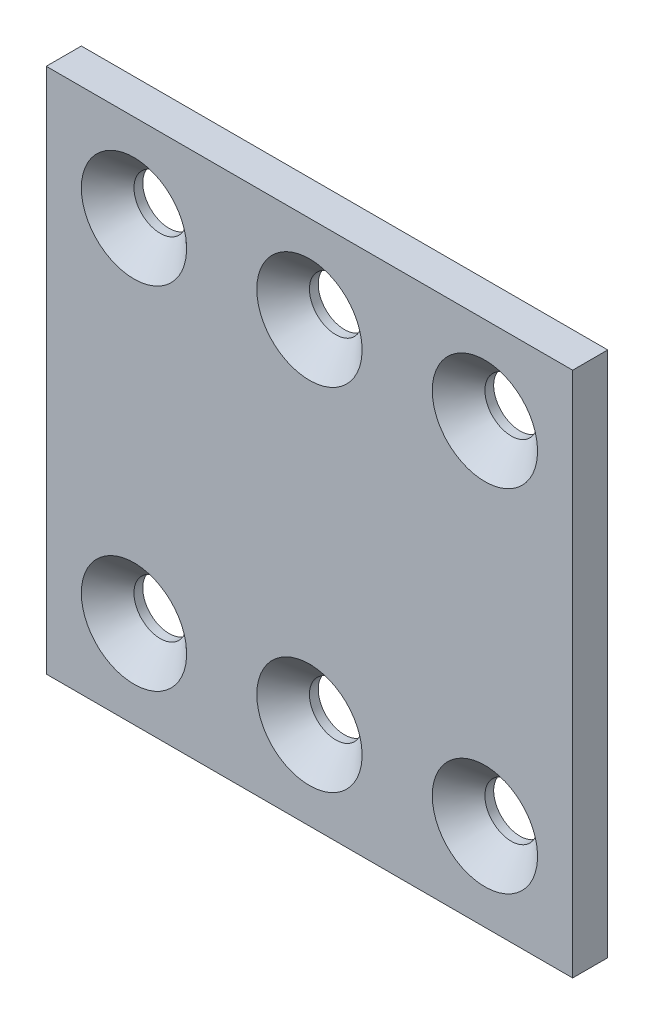
ISO-10303-21;
HEADER;
FILE_DESCRIPTION(('STEP AP214'),'2;1');
FILE_NAME('part.step','',(''),(''),'','','');
FILE_SCHEMA(('AUTOMOTIVE_DESIGN { 1 0 10303 214 1 1 1 1 }'));
ENDSEC;
DATA;
#1=APPLICATION_CONTEXT('core data for automotive mechanical design processes');
#2=APPLICATION_PROTOCOL_DEFINITION('international standard','automotive_design',2000,#1);
#3=PRODUCT_CONTEXT('',#1,'mechanical');
#4=PRODUCT('Part','Part','',(#3));
#5=PRODUCT_RELATED_PRODUCT_CATEGORY('part','',(#4));
#6=PRODUCT_DEFINITION_FORMATION('','',#4);
#7=PRODUCT_DEFINITION_CONTEXT('part definition',#1,'design');
#8=PRODUCT_DEFINITION('design','',#6,#7);
#9=PRODUCT_DEFINITION_SHAPE('','',#8);
#10=(LENGTH_UNIT() NAMED_UNIT(*) SI_UNIT(.MILLI.,.METRE.));
#11=(NAMED_UNIT(*) PLANE_ANGLE_UNIT() SI_UNIT($,.RADIAN.));
#12=(NAMED_UNIT(*) SI_UNIT($,.STERADIAN.) SOLID_ANGLE_UNIT());
#13=UNCERTAINTY_MEASURE_WITH_UNIT(LENGTH_MEASURE(1.E-05),#10,'distance_accuracy_value','');
#14=(GEOMETRIC_REPRESENTATION_CONTEXT(3) GLOBAL_UNCERTAINTY_ASSIGNED_CONTEXT((#13)) GLOBAL_UNIT_ASSIGNED_CONTEXT((#10,
#11,#12)) REPRESENTATION_CONTEXT('',''));
#15=CARTESIAN_POINT('',(0.,0.,0.));
#16=DIRECTION('',(0.,0.,1.));
#17=DIRECTION('',(1.,0.,0.));
#18=AXIS2_PLACEMENT_3D('',#15,#16,#17);
#19=CARTESIAN_POINT('',(30.,-30.,2.));
#20=DIRECTION('',(-1.,0.,0.));
#21=DIRECTION('',(0.,0.,1.));
#22=AXIS2_PLACEMENT_3D('',#19,#20,#21);
#23=PLANE('',#22);
#24=DIRECTION('',(0.,1.,0.));
#25=VECTOR('',#24,1.);
#26=CARTESIAN_POINT('',(30.,-30.,-2.));
#27=LINE('',#26,#25);
#28=CARTESIAN_POINT('',(30.,-30.,-2.));
#29=VERTEX_POINT('',#28);
#30=CARTESIAN_POINT('',(30.,30.,-2.));
#31=VERTEX_POINT('',#30);
#32=EDGE_CURVE('E119',#29,#31,#27,.T.);
#33=ORIENTED_EDGE('',*,*,#32,.T.);
#34=DIRECTION('',(0.,0.,-1.));
#35=VECTOR('',#34,1.);
#36=CARTESIAN_POINT('',(30.,30.,2.));
#37=LINE('',#36,#35);
#38=CARTESIAN_POINT('',(30.,30.,2.));
#39=VERTEX_POINT('',#38);
#40=EDGE_CURVE('E108',#39,#31,#37,.T.);
#41=ORIENTED_EDGE('',*,*,#40,.F.);
#42=DIRECTION('',(0.,1.,0.));
#43=VECTOR('',#42,1.);
#44=CARTESIAN_POINT('',(30.,-30.,2.));
#45=LINE('',#44,#43);
#46=CARTESIAN_POINT('',(30.,-30.,2.));
#47=VERTEX_POINT('',#46);
#48=EDGE_CURVE('E100',#47,#39,#45,.T.);
#49=ORIENTED_EDGE('',*,*,#48,.F.);
#50=DIRECTION('',(0.,0.,-1.));
#51=VECTOR('',#50,1.);
#52=CARTESIAN_POINT('',(30.,-30.,2.));
#53=LINE('',#52,#51);
#54=EDGE_CURVE('E115',#47,#29,#53,.T.);
#55=ORIENTED_EDGE('',*,*,#54,.T.);
#56=EDGE_LOOP('',(#33,#41,#49,#55));
#57=FACE_BOUND('',#56,.T.);
#58=ADVANCED_FACE('F45',(#57),#23,.F.);
#59=CARTESIAN_POINT('',(-30.,30.,2.));
#60=DIRECTION('',(0.,-1.,0.));
#61=DIRECTION('',(0.,0.,-1.));
#62=AXIS2_PLACEMENT_3D('',#59,#60,#61);
#63=PLANE('',#62);
#64=DIRECTION('',(-1.,0.,0.));
#65=VECTOR('',#64,1.);
#66=CARTESIAN_POINT('',(-30.,30.,-2.));
#67=LINE('',#66,#65);
#68=CARTESIAN_POINT('',(-30.,30.,-2.));
#69=VERTEX_POINT('',#68);
#70=EDGE_CURVE('E106',#31,#69,#67,.T.);
#71=ORIENTED_EDGE('',*,*,#70,.T.);
#72=DIRECTION('',(0.,0.,-1.));
#73=VECTOR('',#72,1.);
#74=CARTESIAN_POINT('',(-30.,30.,2.));
#75=LINE('',#74,#73);
#76=CARTESIAN_POINT('',(-30.,30.,2.));
#77=VERTEX_POINT('',#76);
#78=EDGE_CURVE('E104',#77,#69,#75,.T.);
#79=ORIENTED_EDGE('',*,*,#78,.F.);
#80=DIRECTION('',(-1.,0.,0.));
#81=VECTOR('',#80,1.);
#82=CARTESIAN_POINT('',(-30.,30.,2.));
#83=LINE('',#82,#81);
#84=EDGE_CURVE('E95',#39,#77,#83,.T.);
#85=ORIENTED_EDGE('',*,*,#84,.F.);
#86=ORIENTED_EDGE('',*,*,#40,.T.);
#87=EDGE_LOOP('',(#71,#79,#85,#86));
#88=FACE_BOUND('',#87,.T.);
#89=ADVANCED_FACE('F105',(#88),#63,.F.);
#90=CARTESIAN_POINT('',(-30.,-30.,2.));
#91=DIRECTION('',(1.,0.,0.));
#92=DIRECTION('',(0.,0.,-1.));
#93=AXIS2_PLACEMENT_3D('',#90,#91,#92);
#94=PLANE('',#93);
#95=DIRECTION('',(0.,-1.,0.));
#96=VECTOR('',#95,1.);
#97=CARTESIAN_POINT('',(-30.,-30.,-2.));
#98=LINE('',#97,#96);
#99=CARTESIAN_POINT('',(-30.,-30.,-2.));
#100=VERTEX_POINT('',#99);
#101=EDGE_CURVE('E81',#69,#100,#98,.T.);
#102=ORIENTED_EDGE('',*,*,#101,.T.);
#103=DIRECTION('',(0.,0.,-1.));
#104=VECTOR('',#103,1.);
#105=CARTESIAN_POINT('',(-30.,-30.,2.));
#106=LINE('',#105,#104);
#107=CARTESIAN_POINT('',(-30.,-30.,2.));
#108=VERTEX_POINT('',#107);
#109=EDGE_CURVE('E109',#108,#100,#106,.T.);
#110=ORIENTED_EDGE('',*,*,#109,.F.);
#111=DIRECTION('',(0.,-1.,0.));
#112=VECTOR('',#111,1.);
#113=CARTESIAN_POINT('',(-30.,-30.,2.));
#114=LINE('',#113,#112);
#115=EDGE_CURVE('E98',#77,#108,#114,.T.);
#116=ORIENTED_EDGE('',*,*,#115,.F.);
#117=ORIENTED_EDGE('',*,*,#78,.T.);
#118=EDGE_LOOP('',(#102,#110,#116,#117));
#119=FACE_BOUND('',#118,.T.);
#120=ADVANCED_FACE('F111',(#119),#94,.F.);
#121=CARTESIAN_POINT('',(-30.,-30.,2.));
#122=DIRECTION('',(0.,1.,0.));
#123=DIRECTION('',(0.,0.,1.));
#124=AXIS2_PLACEMENT_3D('',#121,#122,#123);
#125=PLANE('',#124);
#126=DIRECTION('',(1.,0.,0.));
#127=VECTOR('',#126,1.);
#128=CARTESIAN_POINT('',(-30.,-30.,-2.));
#129=LINE('',#128,#127);
#130=EDGE_CURVE('E87',#100,#29,#129,.T.);
#131=ORIENTED_EDGE('',*,*,#130,.T.);
#132=ORIENTED_EDGE('',*,*,#54,.F.);
#133=DIRECTION('',(1.,0.,0.));
#134=VECTOR('',#133,1.);
#135=CARTESIAN_POINT('',(-30.,-30.,2.));
#136=LINE('',#135,#134);
#137=EDGE_CURVE('E64',#108,#47,#136,.T.);
#138=ORIENTED_EDGE('',*,*,#137,.F.);
#139=ORIENTED_EDGE('',*,*,#109,.T.);
#140=EDGE_LOOP('',(#131,#132,#138,#139));
#141=FACE_BOUND('',#140,.T.);
#142=ADVANCED_FACE('F297',(#141),#125,.F.);
#143=CARTESIAN_POINT('',(0.,0.,2.));
#144=DIRECTION('',(0.,0.,-1.));
#145=DIRECTION('',(-1.,0.,0.));
#146=AXIS2_PLACEMENT_3D('',#143,#144,#145);
#147=PLANE('',#146);
#148=CARTESIAN_POINT('',(20.,-20.,2.));
#149=DIRECTION('',(0.,0.,-1.));
#150=DIRECTION('',(-1.,0.,0.));
#151=AXIS2_PLACEMENT_3D('',#148,#149,#150);
#152=CIRCLE('',#151,6.00000000000001);
#153=CARTESIAN_POINT('',(14.,-20.,2.));
#154=VERTEX_POINT('',#153);
#155=EDGE_CURVE('E160',#154,#154,#152,.T.);
#156=ORIENTED_EDGE('',*,*,#155,.T.);
#157=EDGE_LOOP('',(#156));
#158=FACE_BOUND('',#157,.T.);
#159=CARTESIAN_POINT('',(0.,-20.,2.));
#160=DIRECTION('',(0.,0.,-1.));
#161=DIRECTION('',(-1.,0.,0.));
#162=AXIS2_PLACEMENT_3D('',#159,#160,#161);
#163=CIRCLE('',#162,6.00000000000001);
#164=CARTESIAN_POINT('',(-6.00000000000001,-20.,2.));
#165=VERTEX_POINT('',#164);
#166=EDGE_CURVE('E156',#165,#165,#163,.T.);
#167=ORIENTED_EDGE('',*,*,#166,.T.);
#168=EDGE_LOOP('',(#167));
#169=FACE_BOUND('',#168,.T.);
#170=CARTESIAN_POINT('',(-20.,-20.,2.));
#171=DIRECTION('',(0.,0.,-1.));
#172=DIRECTION('',(-1.,0.,0.));
#173=AXIS2_PLACEMENT_3D('',#170,#171,#172);
#174=CIRCLE('',#173,6.00000000000001);
#175=CARTESIAN_POINT('',(-26.,-20.,2.));
#176=VERTEX_POINT('',#175);
#177=EDGE_CURVE('E152',#176,#176,#174,.T.);
#178=ORIENTED_EDGE('',*,*,#177,.T.);
#179=EDGE_LOOP('',(#178));
#180=FACE_BOUND('',#179,.T.);
#181=CARTESIAN_POINT('',(20.,20.,2.));
#182=DIRECTION('',(0.,0.,-1.));
#183=DIRECTION('',(-1.,0.,0.));
#184=AXIS2_PLACEMENT_3D('',#181,#182,#183);
#185=CIRCLE('',#184,6.00000000000001);
#186=CARTESIAN_POINT('',(14.,20.,2.));
#187=VERTEX_POINT('',#186);
#188=EDGE_CURVE('E148',#187,#187,#185,.T.);
#189=ORIENTED_EDGE('',*,*,#188,.T.);
#190=EDGE_LOOP('',(#189));
#191=FACE_BOUND('',#190,.T.);
#192=CARTESIAN_POINT('',(0.,20.,2.));
#193=DIRECTION('',(0.,0.,-1.));
#194=DIRECTION('',(-1.,0.,0.));
#195=AXIS2_PLACEMENT_3D('',#192,#193,#194);
#196=CIRCLE('',#195,6.00000000000001);
#197=CARTESIAN_POINT('',(-6.00000000000001,20.,2.));
#198=VERTEX_POINT('',#197);
#199=EDGE_CURVE('E144',#198,#198,#196,.T.);
#200=ORIENTED_EDGE('',*,*,#199,.T.);
#201=EDGE_LOOP('',(#200));
#202=FACE_BOUND('',#201,.T.);
#203=CARTESIAN_POINT('',(-20.,20.,2.));
#204=DIRECTION('',(0.,0.,-1.));
#205=DIRECTION('',(-1.,0.,0.));
#206=AXIS2_PLACEMENT_3D('',#203,#204,#205);
#207=CIRCLE('',#206,6.00000000000001);
#208=CARTESIAN_POINT('',(-26.,20.,2.));
#209=VERTEX_POINT('',#208);
#210=EDGE_CURVE('E140',#209,#209,#207,.T.);
#211=ORIENTED_EDGE('',*,*,#210,.T.);
#212=EDGE_LOOP('',(#211));
#213=FACE_BOUND('',#212,.T.);
#214=ORIENTED_EDGE('',*,*,#48,.T.);
#215=ORIENTED_EDGE('',*,*,#84,.T.);
#216=ORIENTED_EDGE('',*,*,#115,.T.);
#217=ORIENTED_EDGE('',*,*,#137,.T.);
#218=EDGE_LOOP('',(#214,#215,#216,#217));
#219=FACE_BOUND('',#218,.T.);
#220=ADVANCED_FACE('F96',(#158,#169,#180,#191,#202,#213,#219),#147,.F.);
#221=CARTESIAN_POINT('',(0.,0.,-2.));
#222=DIRECTION('',(0.,0.,-1.));
#223=DIRECTION('',(-1.,0.,0.));
#224=AXIS2_PLACEMENT_3D('',#221,#222,#223);
#225=PLANE('',#224);
#226=CARTESIAN_POINT('',(0.,-20.,-2.));
#227=DIRECTION('',(0.,0.,1.));
#228=DIRECTION('',(1.,0.,0.));
#229=AXIS2_PLACEMENT_3D('',#226,#227,#228);
#230=CIRCLE('',#229,3.);
#231=CARTESIAN_POINT('',(3.,-20.,-2.));
#232=VERTEX_POINT('',#231);
#233=EDGE_CURVE('E255',#232,#232,#230,.T.);
#234=ORIENTED_EDGE('',*,*,#233,.T.);
#235=EDGE_LOOP('',(#234));
#236=FACE_BOUND('',#235,.T.);
#237=CARTESIAN_POINT('',(20.,-20.,-2.));
#238=DIRECTION('',(0.,0.,1.));
#239=DIRECTION('',(1.,0.,0.));
#240=AXIS2_PLACEMENT_3D('',#237,#238,#239);
#241=CIRCLE('',#240,3.);
#242=CARTESIAN_POINT('',(23.,-20.,-2.));
#243=VERTEX_POINT('',#242);
#244=EDGE_CURVE('E249',#243,#243,#241,.T.);
#245=ORIENTED_EDGE('',*,*,#244,.T.);
#246=EDGE_LOOP('',(#245));
#247=FACE_BOUND('',#246,.T.);
#248=CARTESIAN_POINT('',(-20.,-20.,-2.));
#249=DIRECTION('',(0.,0.,1.));
#250=DIRECTION('',(1.,0.,0.));
#251=AXIS2_PLACEMENT_3D('',#248,#249,#250);
#252=CIRCLE('',#251,2.99999999999999);
#253=CARTESIAN_POINT('',(-17.,-20.,-2.));
#254=VERTEX_POINT('',#253);
#255=EDGE_CURVE('E246',#254,#254,#252,.T.);
#256=ORIENTED_EDGE('',*,*,#255,.T.);
#257=EDGE_LOOP('',(#256));
#258=FACE_BOUND('',#257,.T.);
#259=CARTESIAN_POINT('',(-20.,20.,-2.));
#260=DIRECTION('',(0.,0.,1.));
#261=DIRECTION('',(1.,0.,0.));
#262=AXIS2_PLACEMENT_3D('',#259,#260,#261);
#263=CIRCLE('',#262,2.99999999999999);
#264=CARTESIAN_POINT('',(-17.,20.,-2.));
#265=VERTEX_POINT('',#264);
#266=EDGE_CURVE('E250',#265,#265,#263,.T.);
#267=ORIENTED_EDGE('',*,*,#266,.T.);
#268=EDGE_LOOP('',(#267));
#269=FACE_BOUND('',#268,.T.);
#270=CARTESIAN_POINT('',(20.,20.,-2.));
#271=DIRECTION('',(0.,0.,1.));
#272=DIRECTION('',(1.,0.,0.));
#273=AXIS2_PLACEMENT_3D('',#270,#271,#272);
#274=CIRCLE('',#273,2.99999999999999);
#275=CARTESIAN_POINT('',(23.,20.,-2.));
#276=VERTEX_POINT('',#275);
#277=EDGE_CURVE('E258',#276,#276,#274,.T.);
#278=ORIENTED_EDGE('',*,*,#277,.T.);
#279=EDGE_LOOP('',(#278));
#280=FACE_BOUND('',#279,.T.);
#281=CARTESIAN_POINT('',(0.,20.,-2.));
#282=DIRECTION('',(0.,0.,1.));
#283=DIRECTION('',(1.,0.,0.));
#284=AXIS2_PLACEMENT_3D('',#281,#282,#283);
#285=CIRCLE('',#284,3.);
#286=CARTESIAN_POINT('',(3.,20.,-2.));
#287=VERTEX_POINT('',#286);
#288=EDGE_CURVE('E123',#287,#287,#285,.T.);
#289=ORIENTED_EDGE('',*,*,#288,.T.);
#290=EDGE_LOOP('',(#289));
#291=FACE_BOUND('',#290,.T.);
#292=ORIENTED_EDGE('',*,*,#32,.F.);
#293=ORIENTED_EDGE('',*,*,#130,.F.);
#294=ORIENTED_EDGE('',*,*,#101,.F.);
#295=ORIENTED_EDGE('',*,*,#70,.F.);
#296=EDGE_LOOP('',(#292,#293,#294,#295));
#297=FACE_BOUND('',#296,.T.);
#298=ADVANCED_FACE('F274',(#236,#247,#258,#269,#280,#291,#297),#225,.T.);
#299=CARTESIAN_POINT('',(0.,20.,-2.));
#300=DIRECTION('',(0.,0.,1.));
#301=DIRECTION('',(1.,0.,0.));
#302=AXIS2_PLACEMENT_3D('',#299,#300,#301);
#303=CYLINDRICAL_SURFACE('',#302,3.);
#304=CARTESIAN_POINT('',(0.,20.,-0.999999999999994));
#305=DIRECTION('',(0.,0.,-1.));
#306=DIRECTION('',(-1.,0.,0.));
#307=AXIS2_PLACEMENT_3D('',#304,#305,#306);
#308=CIRCLE('',#307,3.);
#309=CARTESIAN_POINT('',(-3.,20.,-0.999999999999994));
#310=VERTEX_POINT('',#309);
#311=EDGE_CURVE('E56',#310,#310,#308,.F.);
#312=ORIENTED_EDGE('',*,*,#311,.T.);
#313=EDGE_LOOP('',(#312));
#314=FACE_BOUND('',#313,.T.);
#315=ORIENTED_EDGE('',*,*,#288,.F.);
#316=EDGE_LOOP('',(#315));
#317=FACE_BOUND('',#316,.T.);
#318=ADVANCED_FACE('F179',(#314,#317),#303,.F.);
#319=CARTESIAN_POINT('',(20.,20.,-2.));
#320=DIRECTION('',(0.,0.,1.));
#321=DIRECTION('',(1.,0.,0.));
#322=AXIS2_PLACEMENT_3D('',#319,#320,#321);
#323=CYLINDRICAL_SURFACE('',#322,2.99999999999999);
#324=CARTESIAN_POINT('',(20.,20.,-1.));
#325=DIRECTION('',(0.,0.,-1.));
#326=DIRECTION('',(-1.,0.,0.));
#327=AXIS2_PLACEMENT_3D('',#324,#325,#326);
#328=CIRCLE('',#327,2.99999999999999);
#329=CARTESIAN_POINT('',(17.,20.,-1.));
#330=VERTEX_POINT('',#329);
#331=EDGE_CURVE('E172',#330,#330,#328,.F.);
#332=ORIENTED_EDGE('',*,*,#331,.T.);
#333=EDGE_LOOP('',(#332));
#334=FACE_BOUND('',#333,.T.);
#335=ORIENTED_EDGE('',*,*,#277,.F.);
#336=EDGE_LOOP('',(#335));
#337=FACE_BOUND('',#336,.T.);
#338=ADVANCED_FACE('F277',(#334,#337),#323,.F.);
#339=CARTESIAN_POINT('',(-20.,20.,-2.));
#340=DIRECTION('',(0.,0.,1.));
#341=DIRECTION('',(1.,0.,0.));
#342=AXIS2_PLACEMENT_3D('',#339,#340,#341);
#343=CYLINDRICAL_SURFACE('',#342,2.99999999999999);
#344=CARTESIAN_POINT('',(-20.,20.,-1.));
#345=DIRECTION('',(0.,0.,-1.));
#346=DIRECTION('',(-1.,0.,0.));
#347=AXIS2_PLACEMENT_3D('',#344,#345,#346);
#348=CIRCLE('',#347,2.99999999999999);
#349=CARTESIAN_POINT('',(-23.,20.,-1.));
#350=VERTEX_POINT('',#349);
#351=EDGE_CURVE('E11',#350,#350,#348,.F.);
#352=ORIENTED_EDGE('',*,*,#351,.T.);
#353=EDGE_LOOP('',(#352));
#354=FACE_BOUND('',#353,.T.);
#355=ORIENTED_EDGE('',*,*,#266,.F.);
#356=EDGE_LOOP('',(#355));
#357=FACE_BOUND('',#356,.T.);
#358=ADVANCED_FACE('F242',(#354,#357),#343,.F.);
#359=CARTESIAN_POINT('',(-20.,-20.,-2.));
#360=DIRECTION('',(0.,0.,1.));
#361=DIRECTION('',(1.,0.,0.));
#362=AXIS2_PLACEMENT_3D('',#359,#360,#361);
#363=CYLINDRICAL_SURFACE('',#362,2.99999999999999);
#364=CARTESIAN_POINT('',(-20.,-20.,-1.));
#365=DIRECTION('',(0.,0.,-1.));
#366=DIRECTION('',(-1.,0.,0.));
#367=AXIS2_PLACEMENT_3D('',#364,#365,#366);
#368=CIRCLE('',#367,2.99999999999999);
#369=CARTESIAN_POINT('',(-23.,-20.,-1.));
#370=VERTEX_POINT('',#369);
#371=EDGE_CURVE('E168',#370,#370,#368,.F.);
#372=ORIENTED_EDGE('',*,*,#371,.T.);
#373=EDGE_LOOP('',(#372));
#374=FACE_BOUND('',#373,.T.);
#375=ORIENTED_EDGE('',*,*,#255,.F.);
#376=EDGE_LOOP('',(#375));
#377=FACE_BOUND('',#376,.T.);
#378=ADVANCED_FACE('F238',(#374,#377),#363,.F.);
#379=CARTESIAN_POINT('',(20.,-20.,-2.));
#380=DIRECTION('',(0.,0.,1.));
#381=DIRECTION('',(1.,0.,0.));
#382=AXIS2_PLACEMENT_3D('',#379,#380,#381);
#383=CYLINDRICAL_SURFACE('',#382,3.);
#384=CARTESIAN_POINT('',(20.,-20.,-0.99999999999999));
#385=DIRECTION('',(0.,0.,-1.));
#386=DIRECTION('',(-1.,0.,0.));
#387=AXIS2_PLACEMENT_3D('',#384,#385,#386);
#388=CIRCLE('',#387,3.);
#389=CARTESIAN_POINT('',(17.,-20.,-0.99999999999999));
#390=VERTEX_POINT('',#389);
#391=EDGE_CURVE('E136',#390,#390,#388,.F.);
#392=ORIENTED_EDGE('',*,*,#391,.T.);
#393=EDGE_LOOP('',(#392));
#394=FACE_BOUND('',#393,.T.);
#395=ORIENTED_EDGE('',*,*,#244,.F.);
#396=EDGE_LOOP('',(#395));
#397=FACE_BOUND('',#396,.T.);
#398=ADVANCED_FACE('F241',(#394,#397),#383,.F.);
#399=CARTESIAN_POINT('',(0.,-20.,-2.));
#400=DIRECTION('',(0.,0.,1.));
#401=DIRECTION('',(1.,0.,0.));
#402=AXIS2_PLACEMENT_3D('',#399,#400,#401);
#403=CYLINDRICAL_SURFACE('',#402,3.);
#404=CARTESIAN_POINT('',(0.,-20.,-0.999999999999994));
#405=DIRECTION('',(0.,0.,-1.));
#406=DIRECTION('',(-1.,0.,0.));
#407=AXIS2_PLACEMENT_3D('',#404,#405,#406);
#408=CIRCLE('',#407,3.);
#409=CARTESIAN_POINT('',(-3.,-20.,-0.999999999999994));
#410=VERTEX_POINT('',#409);
#411=EDGE_CURVE('E164',#410,#410,#408,.F.);
#412=ORIENTED_EDGE('',*,*,#411,.T.);
#413=EDGE_LOOP('',(#412));
#414=FACE_BOUND('',#413,.T.);
#415=ORIENTED_EDGE('',*,*,#233,.F.);
#416=EDGE_LOOP('',(#415));
#417=FACE_BOUND('',#416,.T.);
#418=ADVANCED_FACE('F213',(#414,#417),#403,.F.);
#419=CARTESIAN_POINT('',(20.,-20.,-0.99999999999999));
#420=DIRECTION('',(0.,0.,1.));
#421=DIRECTION('',(1.,0.,0.));
#422=AXIS2_PLACEMENT_3D('',#419,#420,#421);
#423=CONICAL_SURFACE('',#422,3.,0.785398163397451);
#424=ORIENTED_EDGE('',*,*,#155,.F.);
#425=EDGE_LOOP('',(#424));
#426=FACE_BOUND('',#425,.T.);
#427=ORIENTED_EDGE('',*,*,#391,.F.);
#428=EDGE_LOOP('',(#427));
#429=FACE_BOUND('',#428,.T.);
#430=ADVANCED_FACE('F206',(#426,#429),#423,.F.);
#431=CARTESIAN_POINT('',(0.,-20.,-0.999999999999994));
#432=DIRECTION('',(0.,0.,1.));
#433=DIRECTION('',(1.,0.,0.));
#434=AXIS2_PLACEMENT_3D('',#431,#432,#433);
#435=CONICAL_SURFACE('',#434,3.,0.785398163397451);
#436=ORIENTED_EDGE('',*,*,#166,.F.);
#437=EDGE_LOOP('',(#436));
#438=FACE_BOUND('',#437,.T.);
#439=ORIENTED_EDGE('',*,*,#411,.F.);
#440=EDGE_LOOP('',(#439));
#441=FACE_BOUND('',#440,.T.);
#442=ADVANCED_FACE('F212',(#438,#441),#435,.F.);
#443=CARTESIAN_POINT('',(-20.,-20.,-1.));
#444=DIRECTION('',(0.,0.,1.));
#445=DIRECTION('',(1.,0.,0.));
#446=AXIS2_PLACEMENT_3D('',#443,#444,#445);
#447=CONICAL_SURFACE('',#446,2.99999999999999,0.785398163397451);
#448=ORIENTED_EDGE('',*,*,#177,.F.);
#449=EDGE_LOOP('',(#448));
#450=FACE_BOUND('',#449,.T.);
#451=ORIENTED_EDGE('',*,*,#371,.F.);
#452=EDGE_LOOP('',(#451));
#453=FACE_BOUND('',#452,.T.);
#454=ADVANCED_FACE('F191',(#450,#453),#447,.F.);
#455=CARTESIAN_POINT('',(20.,20.,-1.));
#456=DIRECTION('',(0.,0.,1.));
#457=DIRECTION('',(1.,0.,0.));
#458=AXIS2_PLACEMENT_3D('',#455,#456,#457);
#459=CONICAL_SURFACE('',#458,2.99999999999999,0.785398163397451);
#460=ORIENTED_EDGE('',*,*,#188,.F.);
#461=EDGE_LOOP('',(#460));
#462=FACE_BOUND('',#461,.T.);
#463=ORIENTED_EDGE('',*,*,#331,.F.);
#464=EDGE_LOOP('',(#463));
#465=FACE_BOUND('',#464,.T.);
#466=ADVANCED_FACE('F184',(#462,#465),#459,.F.);
#467=CARTESIAN_POINT('',(0.,20.,-0.999999999999994));
#468=DIRECTION('',(0.,0.,1.));
#469=DIRECTION('',(1.,0.,0.));
#470=AXIS2_PLACEMENT_3D('',#467,#468,#469);
#471=CONICAL_SURFACE('',#470,3.,0.785398163397451);
#472=ORIENTED_EDGE('',*,*,#199,.F.);
#473=EDGE_LOOP('',(#472));
#474=FACE_BOUND('',#473,.T.);
#475=ORIENTED_EDGE('',*,*,#311,.F.);
#476=EDGE_LOOP('',(#475));
#477=FACE_BOUND('',#476,.T.);
#478=ADVANCED_FACE('F182',(#474,#477),#471,.F.);
#479=CARTESIAN_POINT('',(-20.,20.,-1.));
#480=DIRECTION('',(0.,0.,1.));
#481=DIRECTION('',(1.,0.,0.));
#482=AXIS2_PLACEMENT_3D('',#479,#480,#481);
#483=CONICAL_SURFACE('',#482,2.99999999999999,0.785398163397451);
#484=ORIENTED_EDGE('',*,*,#210,.F.);
#485=EDGE_LOOP('',(#484));
#486=FACE_BOUND('',#485,.T.);
#487=ORIENTED_EDGE('',*,*,#351,.F.);
#488=EDGE_LOOP('',(#487));
#489=FACE_BOUND('',#488,.T.);
#490=ADVANCED_FACE('F48',(#486,#489),#483,.F.);
#491=CLOSED_SHELL('',(#58,#89,#120,#142,#220,#298,#318,#338,#358,#378,#398,#418,#430,#442,#454,
#466,#478,#490));
#492=MANIFOLD_SOLID_BREP('B2',#491);
#493=ADVANCED_BREP_SHAPE_REPRESENTATION('',(#18,#492),#14);
#494=SHAPE_DEFINITION_REPRESENTATION(#9,#493);
ENDSEC;
END-ISO-10303-21;
